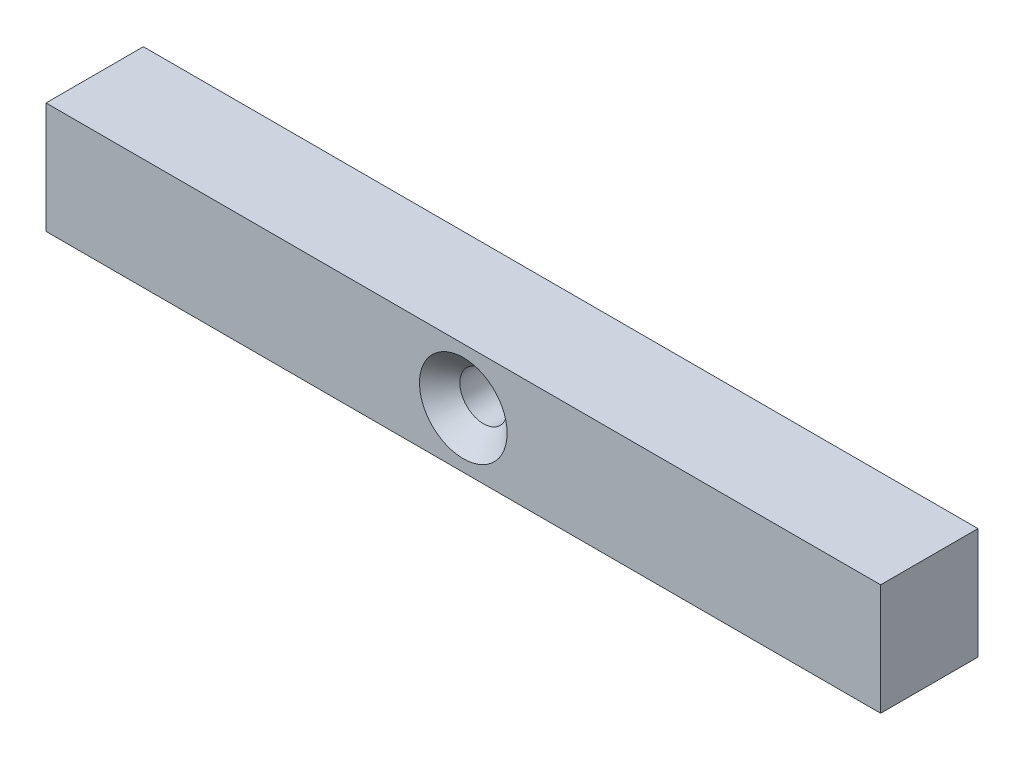
ISO-10303-21;
HEADER;
FILE_DESCRIPTION(('STEP AP214'),'2;1');
FILE_NAME('part.step','',(''),(''),'','','');
FILE_SCHEMA(('AUTOMOTIVE_DESIGN { 1 0 10303 214 1 1 1 1 }'));
ENDSEC;
DATA;
#1=APPLICATION_CONTEXT('core data for automotive mechanical design processes');
#2=APPLICATION_PROTOCOL_DEFINITION('international standard','automotive_design',2000,#1);
#3=PRODUCT_CONTEXT('',#1,'mechanical');
#4=PRODUCT('Part','Part','',(#3));
#5=PRODUCT_RELATED_PRODUCT_CATEGORY('part','',(#4));
#6=PRODUCT_DEFINITION_FORMATION('','',#4);
#7=PRODUCT_DEFINITION_CONTEXT('part definition',#1,'design');
#8=PRODUCT_DEFINITION('design','',#6,#7);
#9=PRODUCT_DEFINITION_SHAPE('','',#8);
#10=(LENGTH_UNIT() NAMED_UNIT(*) SI_UNIT(.MILLI.,.METRE.));
#11=(NAMED_UNIT(*) PLANE_ANGLE_UNIT() SI_UNIT($,.RADIAN.));
#12=(NAMED_UNIT(*) SI_UNIT($,.STERADIAN.) SOLID_ANGLE_UNIT());
#13=UNCERTAINTY_MEASURE_WITH_UNIT(LENGTH_MEASURE(1.E-05),#10,'distance_accuracy_value','');
#14=(GEOMETRIC_REPRESENTATION_CONTEXT(3) GLOBAL_UNCERTAINTY_ASSIGNED_CONTEXT((#13)) GLOBAL_UNIT_ASSIGNED_CONTEXT((#10,
#11,#12)) REPRESENTATION_CONTEXT('',''));
#15=CARTESIAN_POINT('',(0.,0.,0.));
#16=DIRECTION('',(0.,0.,1.));
#17=DIRECTION('',(1.,0.,0.));
#18=AXIS2_PLACEMENT_3D('',#15,#16,#17);
#19=CARTESIAN_POINT('',(30.,-4.,7.));
#20=DIRECTION('',(-1.,0.,0.));
#21=DIRECTION('',(0.,0.,1.));
#22=AXIS2_PLACEMENT_3D('',#19,#20,#21);
#23=PLANE('',#22);
#24=DIRECTION('',(0.,1.,0.));
#25=VECTOR('',#24,1.);
#26=CARTESIAN_POINT('',(30.,-4.,0.));
#27=LINE('',#26,#25);
#28=CARTESIAN_POINT('',(30.,-4.,0.));
#29=VERTEX_POINT('',#28);
#30=CARTESIAN_POINT('',(30.,4.,0.));
#31=VERTEX_POINT('',#30);
#32=EDGE_CURVE('E98',#29,#31,#27,.T.);
#33=ORIENTED_EDGE('',*,*,#32,.T.);
#34=DIRECTION('',(0.,0.,-1.));
#35=VECTOR('',#34,1.);
#36=CARTESIAN_POINT('',(30.,4.,7.));
#37=LINE('',#36,#35);
#38=CARTESIAN_POINT('',(30.,4.,7.));
#39=VERTEX_POINT('',#38);
#40=EDGE_CURVE('E11',#39,#31,#37,.T.);
#41=ORIENTED_EDGE('',*,*,#40,.F.);
#42=DIRECTION('',(0.,1.,0.));
#43=VECTOR('',#42,1.);
#44=CARTESIAN_POINT('',(30.,-4.,7.));
#45=LINE('',#44,#43);
#46=CARTESIAN_POINT('',(30.,-4.,7.));
#47=VERTEX_POINT('',#46);
#48=EDGE_CURVE('E86',#47,#39,#45,.T.);
#49=ORIENTED_EDGE('',*,*,#48,.F.);
#50=DIRECTION('',(0.,0.,-1.));
#51=VECTOR('',#50,1.);
#52=CARTESIAN_POINT('',(30.,-4.,7.));
#53=LINE('',#52,#51);
#54=EDGE_CURVE('E94',#47,#29,#53,.T.);
#55=ORIENTED_EDGE('',*,*,#54,.T.);
#56=EDGE_LOOP('',(#33,#41,#49,#55));
#57=FACE_BOUND('',#56,.T.);
#58=ADVANCED_FACE('F35',(#57),#23,.F.);
#59=CARTESIAN_POINT('',(-30.,4.,7.));
#60=DIRECTION('',(0.,-1.,0.));
#61=DIRECTION('',(0.,0.,-1.));
#62=AXIS2_PLACEMENT_3D('',#59,#60,#61);
#63=PLANE('',#62);
#64=DIRECTION('',(-1.,0.,0.));
#65=VECTOR('',#64,1.);
#66=CARTESIAN_POINT('',(-30.,4.,0.));
#67=LINE('',#66,#65);
#68=CARTESIAN_POINT('',(-30.,4.,0.));
#69=VERTEX_POINT('',#68);
#70=EDGE_CURVE('E90',#31,#69,#67,.T.);
#71=ORIENTED_EDGE('',*,*,#70,.T.);
#72=DIRECTION('',(0.,0.,-1.));
#73=VECTOR('',#72,1.);
#74=CARTESIAN_POINT('',(-30.,4.,7.));
#75=LINE('',#74,#73);
#76=CARTESIAN_POINT('',(-30.,4.,7.));
#77=VERTEX_POINT('',#76);
#78=EDGE_CURVE('E43',#77,#69,#75,.T.);
#79=ORIENTED_EDGE('',*,*,#78,.F.);
#80=DIRECTION('',(-1.,0.,0.));
#81=VECTOR('',#80,1.);
#82=CARTESIAN_POINT('',(-30.,4.,7.));
#83=LINE('',#82,#81);
#84=EDGE_CURVE('E81',#39,#77,#83,.T.);
#85=ORIENTED_EDGE('',*,*,#84,.F.);
#86=ORIENTED_EDGE('',*,*,#40,.T.);
#87=EDGE_LOOP('',(#71,#79,#85,#86));
#88=FACE_BOUND('',#87,.T.);
#89=ADVANCED_FACE('F89',(#88),#63,.F.);
#90=CARTESIAN_POINT('',(-30.,-4.,7.));
#91=DIRECTION('',(1.,0.,0.));
#92=DIRECTION('',(0.,0.,-1.));
#93=AXIS2_PLACEMENT_3D('',#90,#91,#92);
#94=PLANE('',#93);
#95=DIRECTION('',(0.,-1.,0.));
#96=VECTOR('',#95,1.);
#97=CARTESIAN_POINT('',(-30.,-4.,0.));
#98=LINE('',#97,#96);
#99=CARTESIAN_POINT('',(-30.,-4.,0.));
#100=VERTEX_POINT('',#99);
#101=EDGE_CURVE('E68',#69,#100,#98,.T.);
#102=ORIENTED_EDGE('',*,*,#101,.T.);
#103=DIRECTION('',(0.,0.,-1.));
#104=VECTOR('',#103,1.);
#105=CARTESIAN_POINT('',(-30.,-4.,7.));
#106=LINE('',#105,#104);
#107=CARTESIAN_POINT('',(-30.,-4.,7.));
#108=VERTEX_POINT('',#107);
#109=EDGE_CURVE('E91',#108,#100,#106,.T.);
#110=ORIENTED_EDGE('',*,*,#109,.F.);
#111=DIRECTION('',(0.,-1.,0.));
#112=VECTOR('',#111,1.);
#113=CARTESIAN_POINT('',(-30.,-4.,7.));
#114=LINE('',#113,#112);
#115=EDGE_CURVE('E84',#77,#108,#114,.T.);
#116=ORIENTED_EDGE('',*,*,#115,.F.);
#117=ORIENTED_EDGE('',*,*,#78,.T.);
#118=EDGE_LOOP('',(#102,#110,#116,#117));
#119=FACE_BOUND('',#118,.T.);
#120=ADVANCED_FACE('F92',(#119),#94,.F.);
#121=CARTESIAN_POINT('',(-30.,-4.,7.));
#122=DIRECTION('',(0.,1.,0.));
#123=DIRECTION('',(0.,0.,1.));
#124=AXIS2_PLACEMENT_3D('',#121,#122,#123);
#125=PLANE('',#124);
#126=DIRECTION('',(1.,0.,0.));
#127=VECTOR('',#126,1.);
#128=CARTESIAN_POINT('',(-30.,-4.,0.));
#129=LINE('',#128,#127);
#130=EDGE_CURVE('E74',#100,#29,#129,.T.);
#131=ORIENTED_EDGE('',*,*,#130,.T.);
#132=ORIENTED_EDGE('',*,*,#54,.F.);
#133=DIRECTION('',(1.,0.,0.));
#134=VECTOR('',#133,1.);
#135=CARTESIAN_POINT('',(-30.,-4.,7.));
#136=LINE('',#135,#134);
#137=EDGE_CURVE('E51',#108,#47,#136,.T.);
#138=ORIENTED_EDGE('',*,*,#137,.F.);
#139=ORIENTED_EDGE('',*,*,#109,.T.);
#140=EDGE_LOOP('',(#131,#132,#138,#139));
#141=FACE_BOUND('',#140,.T.);
#142=ADVANCED_FACE('F106',(#141),#125,.F.);
#143=CARTESIAN_POINT('',(0.,0.,7.));
#144=DIRECTION('',(0.,0.,-1.));
#145=DIRECTION('',(-1.,0.,0.));
#146=AXIS2_PLACEMENT_3D('',#143,#144,#145);
#147=PLANE('',#146);
#148=CARTESIAN_POINT('',(0.,0.,7.));
#149=DIRECTION('',(0.,0.,1.));
#150=DIRECTION('',(1.,0.,0.));
#151=AXIS2_PLACEMENT_3D('',#148,#149,#150);
#152=CIRCLE('',#151,3.15);
#153=CARTESIAN_POINT('',(3.15,0.,7.));
#154=VERTEX_POINT('',#153);
#155=EDGE_CURVE('E117',#154,#154,#152,.T.);
#156=ORIENTED_EDGE('',*,*,#155,.F.);
#157=EDGE_LOOP('',(#156));
#158=FACE_BOUND('',#157,.T.);
#159=ORIENTED_EDGE('',*,*,#48,.T.);
#160=ORIENTED_EDGE('',*,*,#84,.T.);
#161=ORIENTED_EDGE('',*,*,#115,.T.);
#162=ORIENTED_EDGE('',*,*,#137,.T.);
#163=EDGE_LOOP('',(#159,#160,#161,#162));
#164=FACE_BOUND('',#163,.T.);
#165=ADVANCED_FACE('F82',(#158,#164),#147,.F.);
#166=CARTESIAN_POINT('',(0.,0.,0.));
#167=DIRECTION('',(0.,0.,-1.));
#168=DIRECTION('',(-1.,0.,0.));
#169=AXIS2_PLACEMENT_3D('',#166,#167,#168);
#170=PLANE('',#169);
#171=CARTESIAN_POINT('',(0.,0.,0.));
#172=DIRECTION('',(0.,0.,1.));
#173=DIRECTION('',(1.,0.,0.));
#174=AXIS2_PLACEMENT_3D('',#171,#172,#173);
#175=CIRCLE('',#174,1.7);
#176=CARTESIAN_POINT('',(1.7,0.,0.));
#177=VERTEX_POINT('',#176);
#178=EDGE_CURVE('E101',#177,#177,#175,.T.);
#179=ORIENTED_EDGE('',*,*,#178,.T.);
#180=EDGE_LOOP('',(#179));
#181=FACE_BOUND('',#180,.T.);
#182=ORIENTED_EDGE('',*,*,#32,.F.);
#183=ORIENTED_EDGE('',*,*,#130,.F.);
#184=ORIENTED_EDGE('',*,*,#101,.F.);
#185=ORIENTED_EDGE('',*,*,#70,.F.);
#186=EDGE_LOOP('',(#182,#183,#184,#185));
#187=FACE_BOUND('',#186,.T.);
#188=ADVANCED_FACE('F109',(#181,#187),#170,.T.);
#189=CARTESIAN_POINT('',(0.,0.,7.));
#190=DIRECTION('',(0.,0.,1.));
#191=DIRECTION('',(1.,0.,0.));
#192=AXIS2_PLACEMENT_3D('',#189,#190,#191);
#193=CYLINDRICAL_SURFACE('',#192,1.7);
#194=ORIENTED_EDGE('',*,*,#178,.F.);
#195=EDGE_LOOP('',(#194));
#196=FACE_BOUND('',#195,.T.);
#197=CARTESIAN_POINT('',(0.,0.,5.55));
#198=DIRECTION('',(0.,0.,1.));
#199=DIRECTION('',(1.,0.,0.));
#200=AXIS2_PLACEMENT_3D('',#197,#198,#199);
#201=CIRCLE('',#200,1.7);
#202=CARTESIAN_POINT('',(1.7,0.,5.55));
#203=VERTEX_POINT('',#202);
#204=EDGE_CURVE('E114',#203,#203,#201,.T.);
#205=ORIENTED_EDGE('',*,*,#204,.T.);
#206=EDGE_LOOP('',(#205));
#207=FACE_BOUND('',#206,.T.);
#208=ADVANCED_FACE('F129',(#196,#207),#193,.F.);
#209=CARTESIAN_POINT('',(0.,0.,7.));
#210=DIRECTION('',(0.,0.,1.));
#211=DIRECTION('',(1.,0.,0.));
#212=AXIS2_PLACEMENT_3D('',#209,#210,#211);
#213=CONICAL_SURFACE('',#212,3.15,0.785398163397448);
#214=ORIENTED_EDGE('',*,*,#204,.F.);
#215=EDGE_LOOP('',(#214));
#216=FACE_BOUND('',#215,.T.);
#217=ORIENTED_EDGE('',*,*,#155,.T.);
#218=EDGE_LOOP('',(#217));
#219=FACE_BOUND('',#218,.T.);
#220=ADVANCED_FACE('F121',(#216,#219),#213,.F.);
#221=CLOSED_SHELL('',(#58,#89,#120,#142,#165,#188,#208,#220));
#222=MANIFOLD_SOLID_BREP('B2',#221);
#223=ADVANCED_BREP_SHAPE_REPRESENTATION('',(#18,#222),#14);
#224=SHAPE_DEFINITION_REPRESENTATION(#9,#223);
ENDSEC;
END-ISO-10303-21;
